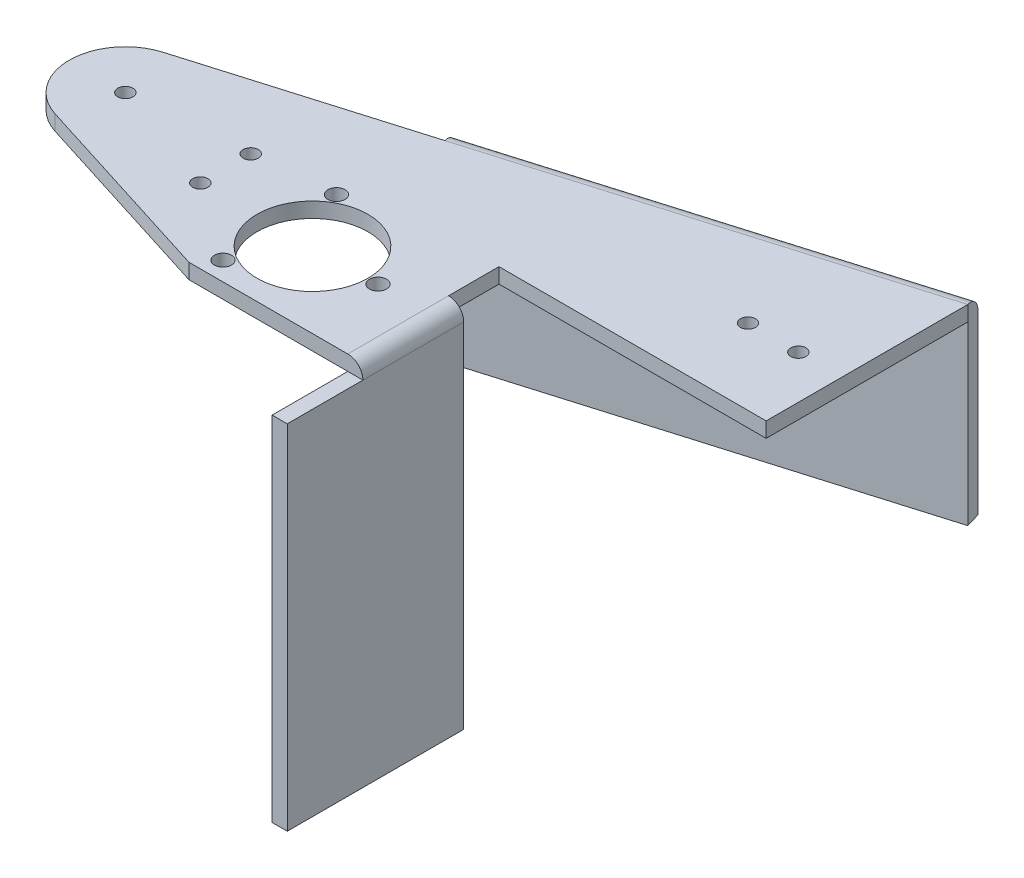
ISO-10303-21;
HEADER;
FILE_DESCRIPTION(('STEP AP214'),'2;1');
FILE_NAME('part.step','',(''),(''),'','','');
FILE_SCHEMA(('AUTOMOTIVE_DESIGN { 1 0 10303 214 1 1 1 1 }'));
ENDSEC;
DATA;
#1=APPLICATION_CONTEXT('core data for automotive mechanical design processes');
#2=APPLICATION_PROTOCOL_DEFINITION('international standard','automotive_design',2000,#1);
#3=PRODUCT_CONTEXT('',#1,'mechanical');
#4=PRODUCT('Part','Part','',(#3));
#5=PRODUCT_RELATED_PRODUCT_CATEGORY('part','',(#4));
#6=PRODUCT_DEFINITION_FORMATION('','',#4);
#7=PRODUCT_DEFINITION_CONTEXT('part definition',#1,'design');
#8=PRODUCT_DEFINITION('design','',#6,#7);
#9=PRODUCT_DEFINITION_SHAPE('','',#8);
#10=(LENGTH_UNIT() NAMED_UNIT(*) SI_UNIT(.MILLI.,.METRE.));
#11=(NAMED_UNIT(*) PLANE_ANGLE_UNIT() SI_UNIT($,.RADIAN.));
#12=(NAMED_UNIT(*) SI_UNIT($,.STERADIAN.) SOLID_ANGLE_UNIT());
#13=UNCERTAINTY_MEASURE_WITH_UNIT(LENGTH_MEASURE(1.E-05),#10,'distance_accuracy_value','');
#14=(GEOMETRIC_REPRESENTATION_CONTEXT(3) GLOBAL_UNCERTAINTY_ASSIGNED_CONTEXT((#13)) GLOBAL_UNIT_ASSIGNED_CONTEXT((#10,
#11,#12)) REPRESENTATION_CONTEXT('',''));
#15=CARTESIAN_POINT('',(0.,0.,0.));
#16=DIRECTION('',(0.,0.,1.));
#17=DIRECTION('',(1.,0.,0.));
#18=AXIS2_PLACEMENT_3D('',#15,#16,#17);
#19=CARTESIAN_POINT('',(-531.814143115865,-3.,-33.209876935335));
#20=DIRECTION('',(0.,-1.,0.));
#21=DIRECTION('',(0.,0.,-1.));
#22=AXIS2_PLACEMENT_3D('',#19,#20,#21);
#23=PLANE('',#22);
#24=CARTESIAN_POINT('',(-430.455543115792,-3.,-55.359876935335));
#25=DIRECTION('',(0.,-1.,0.));
#26=DIRECTION('',(0.,0.,-1.));
#27=AXIS2_PLACEMENT_3D('',#24,#25,#26);
#28=CIRCLE('',#27,1.49999999998116);
#29=CARTESIAN_POINT('',(-430.455543115792,-3.,-56.8598769353162));
#30=VERTEX_POINT('',#29);
#31=EDGE_CURVE('E203',#30,#30,#28,.T.);
#32=ORIENTED_EDGE('',*,*,#31,.F.);
#33=EDGE_LOOP('',(#32));
#34=FACE_BOUND('',#33,.T.);
#35=CARTESIAN_POINT('',(-493.344143115865,-3.,-14.1015466861375));
#36=DIRECTION('',(0.,-1.,0.));
#37=DIRECTION('',(0.,0.,-1.));
#38=AXIS2_PLACEMENT_3D('',#35,#36,#37);
#39=CIRCLE('',#38,1.70000000000349);
#40=CARTESIAN_POINT('',(-493.344143115865,-3.,-15.801546686141));
#41=VERTEX_POINT('',#40);
#42=EDGE_CURVE('E216',#41,#41,#39,.T.);
#43=ORIENTED_EDGE('',*,*,#42,.F.);
#44=EDGE_LOOP('',(#43));
#45=FACE_BOUND('',#44,.T.);
#46=CARTESIAN_POINT('',(-473.844143115865,-3.,-25.3598769353352));
#47=DIRECTION('',(0.,-1.,0.));
#48=DIRECTION('',(0.,0.,-1.));
#49=AXIS2_PLACEMENT_3D('',#46,#47,#48);
#50=CIRCLE('',#49,1.70000000000361);
#51=CARTESIAN_POINT('',(-473.844143115865,-3.,-27.0598769353388));
#52=VERTEX_POINT('',#51);
#53=EDGE_CURVE('E228',#52,#52,#50,.T.);
#54=ORIENTED_EDGE('',*,*,#53,.F.);
#55=EDGE_LOOP('',(#54));
#56=FACE_BOUND('',#55,.T.);
#57=CARTESIAN_POINT('',(-508.844143115865,-3.,-25.113476935338));
#58=DIRECTION('',(0.,-1.,0.));
#59=DIRECTION('',(0.,0.,-1.));
#60=AXIS2_PLACEMENT_3D('',#57,#58,#59);
#61=CIRCLE('',#60,1.49999999999997);
#62=CARTESIAN_POINT('',(-508.844143115865,-3.,-26.613476935338));
#63=VERTEX_POINT('',#62);
#64=EDGE_CURVE('E240',#63,#63,#61,.T.);
#65=ORIENTED_EDGE('',*,*,#64,.F.);
#66=EDGE_LOOP('',(#65));
#67=FACE_BOUND('',#66,.T.);
#68=CARTESIAN_POINT('',(-531.814143115865,-3.,-33.209876935335));
#69=DIRECTION('',(0.,-1.,0.));
#70=DIRECTION('',(0.,0.,-1.));
#71=AXIS2_PLACEMENT_3D('',#68,#69,#70);
#72=CIRCLE('',#71,1.49999999999997);
#73=CARTESIAN_POINT('',(-531.814143115865,-3.,-34.709876935335));
#74=VERTEX_POINT('',#73);
#75=EDGE_CURVE('E252',#74,#74,#72,.T.);
#76=ORIENTED_EDGE('',*,*,#75,.F.);
#77=EDGE_LOOP('',(#76));
#78=FACE_BOUND('',#77,.T.);
#79=CARTESIAN_POINT('',(-508.844143115865,-3.,-35.113476935338));
#80=DIRECTION('',(0.,-1.,0.));
#81=DIRECTION('',(0.,0.,-1.));
#82=AXIS2_PLACEMENT_3D('',#79,#80,#81);
#83=CIRCLE('',#82,1.49999999999997);
#84=CARTESIAN_POINT('',(-508.844143115865,-3.,-36.613476935338));
#85=VERTEX_POINT('',#84);
#86=EDGE_CURVE('E246',#85,#85,#83,.T.);
#87=ORIENTED_EDGE('',*,*,#86,.F.);
#88=EDGE_LOOP('',(#87));
#89=FACE_BOUND('',#88,.T.);
#90=CARTESIAN_POINT('',(-486.844143115865,-3.,-25.359876935335));
#91=DIRECTION('',(0.,-1.,0.));
#92=DIRECTION('',(0.,0.,-1.));
#93=AXIS2_PLACEMENT_3D('',#90,#91,#92);
#94=CIRCLE('',#93,11.0000000000028);
#95=CARTESIAN_POINT('',(-486.844143115865,-3.,-36.3598769353378));
#96=VERTEX_POINT('',#95);
#97=EDGE_CURVE('E234',#96,#96,#94,.T.);
#98=ORIENTED_EDGE('',*,*,#97,.F.);
#99=EDGE_LOOP('',(#98));
#100=FACE_BOUND('',#99,.T.);
#101=CARTESIAN_POINT('',(-493.344143115865,-3.,-36.6182071845329));
#102=DIRECTION('',(0.,-1.,0.));
#103=DIRECTION('',(0.,0.,-1.));
#104=AXIS2_PLACEMENT_3D('',#101,#102,#103);
#105=CIRCLE('',#104,1.70000000000345);
#106=CARTESIAN_POINT('',(-493.344143115865,-3.,-38.3182071845364));
#107=VERTEX_POINT('',#106);
#108=EDGE_CURVE('E222',#107,#107,#105,.T.);
#109=ORIENTED_EDGE('',*,*,#108,.F.);
#110=EDGE_LOOP('',(#109));
#111=FACE_BOUND('',#110,.T.);
#112=CARTESIAN_POINT('',(-420.455543115792,-3.,-55.359876935335));
#113=DIRECTION('',(0.,-1.,0.));
#114=DIRECTION('',(0.,0.,-1.));
#115=AXIS2_PLACEMENT_3D('',#112,#113,#114);
#116=CIRCLE('',#115,1.49999999998116);
#117=CARTESIAN_POINT('',(-420.455543115792,-3.,-56.8598769353162));
#118=VERTEX_POINT('',#117);
#119=EDGE_CURVE('E210',#118,#118,#116,.T.);
#120=ORIENTED_EDGE('',*,*,#119,.F.);
#121=EDGE_LOOP('',(#120));
#122=FACE_BOUND('',#121,.T.);
#123=DIRECTION('',(0.958808610714418,0.,-0.284052896517335));
#124=VECTOR('',#123,1.);
#125=CARTESIAN_POINT('',(-534.975651854103,-3.,-43.8814167725865));
#126=LINE('',#125,#124);
#127=CARTESIAN_POINT('',(-534.975651854103,-3.,-43.8814167725865));
#128=VERTEX_POINT('',#127);
#129=CARTESIAN_POINT('',(-491.844143115865,-3.,-56.6593891972715));
#130=VERTEX_POINT('',#129);
#131=EDGE_CURVE('E261',#128,#130,#126,.T.);
#132=ORIENTED_EDGE('',*,*,#131,.T.);
#133=DIRECTION('',(-0.958808610714418,0.,0.284052896517336));
#134=VECTOR('',#133,1.);
#135=CARTESIAN_POINT('',(-491.844143115865,-2.99999999997629,-56.6593891972714));
#136=LINE('',#135,#134);
#137=CARTESIAN_POINT('',(-411.844143115865,-2.9999999999805,-80.359876935335));
#138=VERTEX_POINT('',#137);
#139=EDGE_CURVE('E165',#138,#130,#136,.T.);
#140=ORIENTED_EDGE('',*,*,#139,.F.);
#141=DIRECTION('',(0.,0.,1.));
#142=VECTOR('',#141,1.);
#143=CARTESIAN_POINT('',(-411.844143115865,-3.,-40.359876935335));
#144=LINE('',#143,#142);
#145=CARTESIAN_POINT('',(-411.844143115865,-3.,-40.359876935335));
#146=VERTEX_POINT('',#145);
#147=EDGE_CURVE('E264',#138,#146,#144,.T.);
#148=ORIENTED_EDGE('',*,*,#147,.T.);
#149=DIRECTION('',(-1.,0.,0.));
#150=VECTOR('',#149,1.);
#151=CARTESIAN_POINT('',(-464.844143115865,-3.,-40.359876935335));
#152=LINE('',#151,#150);
#153=CARTESIAN_POINT('',(-464.844143115865,-3.,-40.359876935335));
#154=VERTEX_POINT('',#153);
#155=EDGE_CURVE('E266',#146,#154,#152,.T.);
#156=ORIENTED_EDGE('',*,*,#155,.T.);
#157=DIRECTION('',(0.,0.,1.));
#158=VECTOR('',#157,1.);
#159=CARTESIAN_POINT('',(-464.844143115865,-3.,-30.359876935335));
#160=LINE('',#159,#158);
#161=CARTESIAN_POINT('',(-464.844143115865,-2.99999999997735,-30.359876935335));
#162=VERTEX_POINT('',#161);
#163=EDGE_CURVE('E268',#154,#162,#160,.T.);
#164=ORIENTED_EDGE('',*,*,#163,.T.);
#165=DIRECTION('',(0.,0.,-1.));
#166=VECTOR('',#165,1.);
#167=CARTESIAN_POINT('',(-464.844143115865,-2.99999999997697,4.64012306466499));
#168=LINE('',#167,#166);
#169=CARTESIAN_POINT('',(-464.844143115865,-3.,-10.359876935335));
#170=VERTEX_POINT('',#169);
#171=EDGE_CURVE('E195',#170,#162,#168,.T.);
#172=ORIENTED_EDGE('',*,*,#171,.F.);
#173=DIRECTION('',(-1.,0.,0.));
#174=VECTOR('',#173,1.);
#175=CARTESIAN_POINT('',(-461.844143115865,-3.,-10.359876935335));
#176=LINE('',#175,#174);
#177=CARTESIAN_POINT('',(-496.344143115865,-3.,-10.359876935335));
#178=VERTEX_POINT('',#177);
#179=EDGE_CURVE('E271',#170,#178,#176,.T.);
#180=ORIENTED_EDGE('',*,*,#179,.T.);
#181=DIRECTION('',(-0.953743563350818,0.,-0.300621382085313));
#182=VECTOR('',#181,1.);
#183=CARTESIAN_POINT('',(-496.344143115865,-3.,-10.359876935335));
#184=LINE('',#183,#182);
#185=CARTESIAN_POINT('',(-535.160059098475,-3.,-22.5947110752404));
#186=VERTEX_POINT('',#185);
#187=EDGE_CURVE('E275',#178,#186,#184,.T.);
#188=ORIENTED_EDGE('',*,*,#187,.T.);
#189=CARTESIAN_POINT('',(-531.814143115865,-3.,-33.209876935335));
#190=DIRECTION('',(0.,-1.,0.));
#191=DIRECTION('',(0.,0.,-1.));
#192=AXIS2_PLACEMENT_3D('',#189,#190,#191);
#193=CIRCLE('',#192,11.13);
#194=EDGE_CURVE('E258',#186,#128,#193,.T.);
#195=ORIENTED_EDGE('',*,*,#194,.T.);
#196=EDGE_LOOP('',(#132,#140,#148,#156,#164,#172,#180,#188,#195));
#197=FACE_BOUND('',#196,.T.);
#198=ADVANCED_FACE('F33',(#34,#45,#56,#67,#78,#89,#100,#111,#122,#197),#23,.T.);
#199=CARTESIAN_POINT('',(-531.814143115865,0.,-33.209876935335));
#200=DIRECTION('',(0.,-1.,0.));
#201=DIRECTION('',(0.,0.,-1.));
#202=AXIS2_PLACEMENT_3D('',#199,#200,#201);
#203=PLANE('',#202);
#204=CARTESIAN_POINT('',(-420.455543115792,0.,-55.359876935335));
#205=DIRECTION('',(0.,-1.,0.));
#206=DIRECTION('',(0.,0.,-1.));
#207=AXIS2_PLACEMENT_3D('',#204,#205,#206);
#208=CIRCLE('',#207,1.49999999998116);
#209=CARTESIAN_POINT('',(-420.455543115792,0.,-56.8598769353162));
#210=VERTEX_POINT('',#209);
#211=EDGE_CURVE('E206',#210,#210,#208,.T.);
#212=ORIENTED_EDGE('',*,*,#211,.T.);
#213=EDGE_LOOP('',(#212));
#214=FACE_BOUND('',#213,.T.);
#215=CARTESIAN_POINT('',(-493.344143115865,0.,-36.6182071845329));
#216=DIRECTION('',(0.,-1.,0.));
#217=DIRECTION('',(0.,0.,-1.));
#218=AXIS2_PLACEMENT_3D('',#215,#216,#217);
#219=CIRCLE('',#218,1.70000000000345);
#220=CARTESIAN_POINT('',(-493.344143115865,0.,-38.3182071845364));
#221=VERTEX_POINT('',#220);
#222=EDGE_CURVE('E219',#221,#221,#219,.T.);
#223=ORIENTED_EDGE('',*,*,#222,.T.);
#224=EDGE_LOOP('',(#223));
#225=FACE_BOUND('',#224,.T.);
#226=CARTESIAN_POINT('',(-486.844143115865,0.,-25.359876935335));
#227=DIRECTION('',(0.,-1.,0.));
#228=DIRECTION('',(0.,0.,-1.));
#229=AXIS2_PLACEMENT_3D('',#226,#227,#228);
#230=CIRCLE('',#229,11.0000000000028);
#231=CARTESIAN_POINT('',(-486.844143115865,0.,-36.3598769353378));
#232=VERTEX_POINT('',#231);
#233=EDGE_CURVE('E231',#232,#232,#230,.T.);
#234=ORIENTED_EDGE('',*,*,#233,.T.);
#235=EDGE_LOOP('',(#234));
#236=FACE_BOUND('',#235,.T.);
#237=CARTESIAN_POINT('',(-508.844143115865,0.,-35.113476935338));
#238=DIRECTION('',(0.,-1.,0.));
#239=DIRECTION('',(0.,0.,-1.));
#240=AXIS2_PLACEMENT_3D('',#237,#238,#239);
#241=CIRCLE('',#240,1.49999999999997);
#242=CARTESIAN_POINT('',(-508.844143115865,0.,-36.613476935338));
#243=VERTEX_POINT('',#242);
#244=EDGE_CURVE('E243',#243,#243,#241,.T.);
#245=ORIENTED_EDGE('',*,*,#244,.T.);
#246=EDGE_LOOP('',(#245));
#247=FACE_BOUND('',#246,.T.);
#248=DIRECTION('',(-1.,0.,0.));
#249=VECTOR('',#248,1.);
#250=CARTESIAN_POINT('',(-461.844143115865,0.,-10.359876935335));
#251=LINE('',#250,#249);
#252=CARTESIAN_POINT('',(-464.844143115865,0.,-10.359876935335));
#253=VERTEX_POINT('',#252);
#254=CARTESIAN_POINT('',(-496.344143115865,0.,-10.359876935335));
#255=VERTEX_POINT('',#254);
#256=EDGE_CURVE('E400',#253,#255,#251,.T.);
#257=ORIENTED_EDGE('',*,*,#256,.F.);
#258=DIRECTION('',(0.,0.,1.));
#259=VECTOR('',#258,1.);
#260=CARTESIAN_POINT('',(-464.844143115865,0.,-33.209876935335));
#261=LINE('',#260,#259);
#262=CARTESIAN_POINT('',(-464.844143115865,0.,-30.359876935335));
#263=VERTEX_POINT('',#262);
#264=EDGE_CURVE('E294',#253,#263,#261,.F.);
#265=ORIENTED_EDGE('',*,*,#264,.T.);
#266=DIRECTION('',(0.,0.,1.));
#267=VECTOR('',#266,1.);
#268=CARTESIAN_POINT('',(-464.844143115865,0.,-30.359876935335));
#269=LINE('',#268,#267);
#270=CARTESIAN_POINT('',(-464.844143115865,0.,-40.359876935335));
#271=VERTEX_POINT('',#270);
#272=EDGE_CURVE('E397',#271,#263,#269,.T.);
#273=ORIENTED_EDGE('',*,*,#272,.F.);
#274=DIRECTION('',(-1.,0.,0.));
#275=VECTOR('',#274,1.);
#276=CARTESIAN_POINT('',(-464.844143115865,0.,-40.359876935335));
#277=LINE('',#276,#275);
#278=CARTESIAN_POINT('',(-411.844143115865,0.,-40.359876935335));
#279=VERTEX_POINT('',#278);
#280=EDGE_CURVE('E321',#279,#271,#277,.T.);
#281=ORIENTED_EDGE('',*,*,#280,.F.);
#282=DIRECTION('',(0.,0.,1.));
#283=VECTOR('',#282,1.);
#284=CARTESIAN_POINT('',(-411.844143115865,0.,-40.359876935335));
#285=LINE('',#284,#283);
#286=CARTESIAN_POINT('',(-411.844143115865,0.,-80.359876935335));
#287=VERTEX_POINT('',#286);
#288=EDGE_CURVE('E310',#287,#279,#285,.T.);
#289=ORIENTED_EDGE('',*,*,#288,.F.);
#290=DIRECTION('',(0.958808610714418,0.,-0.284052896517336));
#291=VECTOR('',#290,1.);
#292=CARTESIAN_POINT('',(-534.975651854103,0.,-43.8814167725865));
#293=LINE('',#292,#291);
#294=CARTESIAN_POINT('',(-491.844143115865,0.,-56.6593891972715));
#295=VERTEX_POINT('',#294);
#296=EDGE_CURVE('E290',#287,#295,#293,.F.);
#297=ORIENTED_EDGE('',*,*,#296,.T.);
#298=DIRECTION('',(0.958808610714418,0.,-0.284052896517335));
#299=VECTOR('',#298,1.);
#300=CARTESIAN_POINT('',(-534.975651854103,0.,-43.8814167725865));
#301=LINE('',#300,#299);
#302=CARTESIAN_POINT('',(-534.975651854103,0.,-43.8814167725865));
#303=VERTEX_POINT('',#302);
#304=EDGE_CURVE('E322',#303,#295,#301,.T.);
#305=ORIENTED_EDGE('',*,*,#304,.F.);
#306=CARTESIAN_POINT('',(-531.814143115865,0.,-33.209876935335));
#307=DIRECTION('',(0.,-1.,0.));
#308=DIRECTION('',(0.,0.,-1.));
#309=AXIS2_PLACEMENT_3D('',#306,#307,#308);
#310=CIRCLE('',#309,11.13);
#311=CARTESIAN_POINT('',(-535.160059098475,0.,-22.5947110752404));
#312=VERTEX_POINT('',#311);
#313=EDGE_CURVE('E255',#312,#303,#310,.T.);
#314=ORIENTED_EDGE('',*,*,#313,.F.);
#315=DIRECTION('',(-0.953743563350818,0.,-0.300621382085313));
#316=VECTOR('',#315,1.);
#317=CARTESIAN_POINT('',(-496.344143115865,0.,-10.359876935335));
#318=LINE('',#317,#316);
#319=EDGE_CURVE('E262',#255,#312,#318,.T.);
#320=ORIENTED_EDGE('',*,*,#319,.F.);
#321=EDGE_LOOP('',(#257,#265,#273,#281,#289,#297,#305,#314,#320));
#322=FACE_BOUND('',#321,.T.);
#323=CARTESIAN_POINT('',(-531.814143115865,0.,-33.209876935335));
#324=DIRECTION('',(0.,-1.,0.));
#325=DIRECTION('',(0.,0.,-1.));
#326=AXIS2_PLACEMENT_3D('',#323,#324,#325);
#327=CIRCLE('',#326,1.49999999999997);
#328=CARTESIAN_POINT('',(-531.814143115865,0.,-34.709876935335));
#329=VERTEX_POINT('',#328);
#330=EDGE_CURVE('E249',#329,#329,#327,.T.);
#331=ORIENTED_EDGE('',*,*,#330,.T.);
#332=EDGE_LOOP('',(#331));
#333=FACE_BOUND('',#332,.T.);
#334=CARTESIAN_POINT('',(-508.844143115865,0.,-25.113476935338));
#335=DIRECTION('',(0.,-1.,0.));
#336=DIRECTION('',(0.,0.,-1.));
#337=AXIS2_PLACEMENT_3D('',#334,#335,#336);
#338=CIRCLE('',#337,1.49999999999997);
#339=CARTESIAN_POINT('',(-508.844143115865,0.,-26.613476935338));
#340=VERTEX_POINT('',#339);
#341=EDGE_CURVE('E237',#340,#340,#338,.T.);
#342=ORIENTED_EDGE('',*,*,#341,.T.);
#343=EDGE_LOOP('',(#342));
#344=FACE_BOUND('',#343,.T.);
#345=CARTESIAN_POINT('',(-473.844143115865,0.,-25.3598769353352));
#346=DIRECTION('',(0.,-1.,0.));
#347=DIRECTION('',(0.,0.,-1.));
#348=AXIS2_PLACEMENT_3D('',#345,#346,#347);
#349=CIRCLE('',#348,1.70000000000361);
#350=CARTESIAN_POINT('',(-473.844143115865,0.,-27.0598769353388));
#351=VERTEX_POINT('',#350);
#352=EDGE_CURVE('E225',#351,#351,#349,.T.);
#353=ORIENTED_EDGE('',*,*,#352,.T.);
#354=EDGE_LOOP('',(#353));
#355=FACE_BOUND('',#354,.T.);
#356=CARTESIAN_POINT('',(-493.344143115865,0.,-14.1015466861375));
#357=DIRECTION('',(0.,-1.,0.));
#358=DIRECTION('',(0.,0.,-1.));
#359=AXIS2_PLACEMENT_3D('',#356,#357,#358);
#360=CIRCLE('',#359,1.70000000000349);
#361=CARTESIAN_POINT('',(-493.344143115865,0.,-15.801546686141));
#362=VERTEX_POINT('',#361);
#363=EDGE_CURVE('E213',#362,#362,#360,.T.);
#364=ORIENTED_EDGE('',*,*,#363,.T.);
#365=EDGE_LOOP('',(#364));
#366=FACE_BOUND('',#365,.T.);
#367=CARTESIAN_POINT('',(-430.455543115792,0.,-55.359876935335));
#368=DIRECTION('',(0.,-1.,0.));
#369=DIRECTION('',(0.,0.,-1.));
#370=AXIS2_PLACEMENT_3D('',#367,#368,#369);
#371=CIRCLE('',#370,1.49999999998116);
#372=CARTESIAN_POINT('',(-430.455543115792,0.,-56.8598769353162));
#373=VERTEX_POINT('',#372);
#374=EDGE_CURVE('E207',#373,#373,#371,.T.);
#375=ORIENTED_EDGE('',*,*,#374,.T.);
#376=EDGE_LOOP('',(#375));
#377=FACE_BOUND('',#376,.T.);
#378=ADVANCED_FACE('F317',(#214,#225,#236,#247,#322,#333,#344,#355,#366,#377),#203,.F.);
#379=CARTESIAN_POINT('',(-531.814143115865,-3.,-33.209876935335));
#380=DIRECTION('',(0.,1.,0.));
#381=DIRECTION('',(0.,0.,1.));
#382=AXIS2_PLACEMENT_3D('',#379,#380,#381);
#383=CYLINDRICAL_SURFACE('',#382,11.13);
#384=ORIENTED_EDGE('',*,*,#313,.T.);
#385=DIRECTION('',(0.,1.,0.));
#386=VECTOR('',#385,1.);
#387=CARTESIAN_POINT('',(-534.975651854103,-3.,-43.8814167725865));
#388=LINE('',#387,#386);
#389=EDGE_CURVE('E281',#128,#303,#388,.T.);
#390=ORIENTED_EDGE('',*,*,#389,.F.);
#391=ORIENTED_EDGE('',*,*,#194,.F.);
#392=DIRECTION('',(0.,1.,0.));
#393=VECTOR('',#392,1.);
#394=CARTESIAN_POINT('',(-535.160059098475,-3.,-22.5947110752404));
#395=LINE('',#394,#393);
#396=EDGE_CURVE('E392',#186,#312,#395,.T.);
#397=ORIENTED_EDGE('',*,*,#396,.T.);
#398=EDGE_LOOP('',(#384,#390,#391,#397));
#399=FACE_BOUND('',#398,.T.);
#400=ADVANCED_FACE('F336',(#399),#383,.T.);
#401=CARTESIAN_POINT('',(-534.975651854103,-3.,-43.8814167725865));
#402=DIRECTION('',(0.284052896517335,0.,0.958808610714418));
#403=DIRECTION('',(0.958808610714418,0.,-0.284052896517335));
#404=AXIS2_PLACEMENT_3D('',#401,#402,#403);
#405=PLANE('',#404);
#406=ORIENTED_EDGE('',*,*,#304,.T.);
#407=DIRECTION('',(0.,1.,0.));
#408=VECTOR('',#407,1.);
#409=CARTESIAN_POINT('',(-491.844143115865,-3.,-56.6593891972715));
#410=LINE('',#409,#408);
#411=EDGE_CURVE('E150',#130,#295,#410,.T.);
#412=ORIENTED_EDGE('',*,*,#411,.F.);
#413=ORIENTED_EDGE('',*,*,#131,.F.);
#414=ORIENTED_EDGE('',*,*,#389,.T.);
#415=EDGE_LOOP('',(#406,#412,#413,#414));
#416=FACE_BOUND('',#415,.T.);
#417=ADVANCED_FACE('F377',(#416),#405,.F.);
#418=CARTESIAN_POINT('',(-491.844143115865,-3.,-56.6593891972715));
#419=DIRECTION('',(0.958808610714385,0.,-0.284052896517447));
#420=DIRECTION('',(-0.284052896517447,0.,-0.958808610714385));
#421=AXIS2_PLACEMENT_3D('',#418,#419,#420);
#422=PLANE('',#421);
#423=ORIENTED_EDGE('',*,*,#411,.T.);
#424=CARTESIAN_POINT('',(-491.844143115865,-3.,-56.6593891972715));
#425=DIRECTION('',(0.958808610714385,0.,-0.284052896517447));
#426=DIRECTION('',(-0.284052896517447,0.,-0.958808610714385));
#427=AXIS2_PLACEMENT_3D('',#424,#425,#426);
#428=CIRCLE('',#427,3.);
#429=CARTESIAN_POINT('',(-492.696301805417,-3.,-59.5358150294147));
#430=VERTEX_POINT('',#429);
#431=EDGE_CURVE('E11',#295,#430,#428,.F.);
#432=ORIENTED_EDGE('',*,*,#431,.T.);
#433=DIRECTION('',(0.,1.,0.));
#434=VECTOR('',#433,1.);
#435=CARTESIAN_POINT('',(-492.696301805417,-3.,-59.5358150294147));
#436=LINE('',#435,#434);
#437=CARTESIAN_POINT('',(-492.696301805419,-37.9999999999763,-59.5358150294143));
#438=VERTEX_POINT('',#437);
#439=EDGE_CURVE('E143',#438,#430,#436,.T.);
#440=ORIENTED_EDGE('',*,*,#439,.F.);
#441=DIRECTION('',(-0.284052896517339,0.,-0.958808610714417));
#442=VECTOR('',#441,1.);
#443=CARTESIAN_POINT('',(-492.696301805419,-37.9999999999763,-59.5358150294143));
#444=LINE('',#443,#442);
#445=CARTESIAN_POINT('',(-491.844143115867,-37.9999999999763,-56.6593891972711));
#446=VERTEX_POINT('',#445);
#447=EDGE_CURVE('E148',#446,#438,#444,.T.);
#448=ORIENTED_EDGE('',*,*,#447,.F.);
#449=DIRECTION('',(0.,1.,0.));
#450=VECTOR('',#449,1.);
#451=CARTESIAN_POINT('',(-491.844143115867,-37.9999999999763,-56.6593891972711));
#452=LINE('',#451,#450);
#453=EDGE_CURVE('E171',#446,#130,#452,.T.);
#454=ORIENTED_EDGE('',*,*,#453,.T.);
#455=EDGE_LOOP('',(#423,#432,#440,#448,#454));
#456=FACE_BOUND('',#455,.T.);
#457=ADVANCED_FACE('F145',(#456),#422,.F.);
#458=CARTESIAN_POINT('',(-492.696301805417,-3.,-59.5358150294147));
#459=DIRECTION('',(0.284052896517336,0.,0.958808610714418));
#460=DIRECTION('',(0.958808610714418,0.,-0.284052896517336));
#461=AXIS2_PLACEMENT_3D('',#458,#459,#460);
#462=PLANE('',#461);
#463=ORIENTED_EDGE('',*,*,#439,.T.);
#464=DIRECTION('',(0.958808610714418,0.,-0.284052896517336));
#465=VECTOR('',#464,1.);
#466=CARTESIAN_POINT('',(-492.696301805417,-3.,-59.5358150294147));
#467=LINE('',#466,#465);
#468=CARTESIAN_POINT('',(-412.696301805417,-3.,-83.2363027674783));
#469=VERTEX_POINT('',#468);
#470=EDGE_CURVE('E298',#430,#469,#467,.T.);
#471=ORIENTED_EDGE('',*,*,#470,.T.);
#472=DIRECTION('',(0.,1.,0.));
#473=VECTOR('',#472,1.);
#474=CARTESIAN_POINT('',(-412.696301805417,-3.,-83.2363027674783));
#475=LINE('',#474,#473);
#476=CARTESIAN_POINT('',(-412.696301805419,-37.9999999999805,-83.2363027674779));
#477=VERTEX_POINT('',#476);
#478=EDGE_CURVE('E151',#477,#469,#475,.T.);
#479=ORIENTED_EDGE('',*,*,#478,.F.);
#480=DIRECTION('',(0.958808610714418,0.,-0.284052896517336));
#481=VECTOR('',#480,1.);
#482=CARTESIAN_POINT('',(-492.696301805419,-37.9999999999763,-59.5358150294143));
#483=LINE('',#482,#481);
#484=EDGE_CURVE('E154',#438,#477,#483,.T.);
#485=ORIENTED_EDGE('',*,*,#484,.F.);
#486=EDGE_LOOP('',(#463,#471,#479,#485));
#487=FACE_BOUND('',#486,.T.);
#488=ADVANCED_FACE('F155',(#487),#462,.F.);
#489=CARTESIAN_POINT('',(-412.696301805417,-3.,-83.2363027674783));
#490=DIRECTION('',(-0.958808610714411,0.,0.284052896517357));
#491=DIRECTION('',(0.284052896517357,0.,0.958808610714411));
#492=AXIS2_PLACEMENT_3D('',#489,#490,#491);
#493=PLANE('',#492);
#494=ORIENTED_EDGE('',*,*,#478,.T.);
#495=CARTESIAN_POINT('',(-411.844143115865,-3.,-80.359876935335));
#496=DIRECTION('',(-0.958808610714411,0.,0.284052896517357));
#497=DIRECTION('',(0.284052896517357,0.,0.958808610714411));
#498=AXIS2_PLACEMENT_3D('',#495,#496,#497);
#499=CIRCLE('',#498,3.);
#500=EDGE_CURVE('E41',#469,#287,#499,.F.);
#501=ORIENTED_EDGE('',*,*,#500,.T.);
#502=DIRECTION('',(0.,1.,0.));
#503=VECTOR('',#502,1.);
#504=CARTESIAN_POINT('',(-411.844143115865,-3.,-80.359876935335));
#505=LINE('',#504,#503);
#506=EDGE_CURVE('E304',#138,#287,#505,.T.);
#507=ORIENTED_EDGE('',*,*,#506,.F.);
#508=DIRECTION('',(0.,1.,0.));
#509=VECTOR('',#508,1.);
#510=CARTESIAN_POINT('',(-411.844143115867,-37.9999999999805,-80.3598769353346));
#511=LINE('',#510,#509);
#512=CARTESIAN_POINT('',(-411.844143115867,-37.9999999999805,-80.3598769353346));
#513=VERTEX_POINT('',#512);
#514=EDGE_CURVE('E174',#513,#138,#511,.T.);
#515=ORIENTED_EDGE('',*,*,#514,.F.);
#516=DIRECTION('',(0.284052896517339,0.,0.958808610714417));
#517=VECTOR('',#516,1.);
#518=CARTESIAN_POINT('',(-412.696301805419,-37.9999999999805,-83.2363027674779));
#519=LINE('',#518,#517);
#520=EDGE_CURVE('E159',#477,#513,#519,.T.);
#521=ORIENTED_EDGE('',*,*,#520,.F.);
#522=EDGE_LOOP('',(#494,#501,#507,#515,#521));
#523=FACE_BOUND('',#522,.T.);
#524=ADVANCED_FACE('F302',(#523),#493,.F.);
#525=CARTESIAN_POINT('',(-411.844143115865,-3.,-40.359876935335));
#526=DIRECTION('',(-1.,0.,0.));
#527=DIRECTION('',(0.,0.,1.));
#528=AXIS2_PLACEMENT_3D('',#525,#526,#527);
#529=PLANE('',#528);
#530=ORIENTED_EDGE('',*,*,#288,.T.);
#531=DIRECTION('',(0.,1.,0.));
#532=VECTOR('',#531,1.);
#533=CARTESIAN_POINT('',(-411.844143115865,-3.,-40.359876935335));
#534=LINE('',#533,#532);
#535=EDGE_CURVE('E312',#146,#279,#534,.T.);
#536=ORIENTED_EDGE('',*,*,#535,.F.);
#537=ORIENTED_EDGE('',*,*,#147,.F.);
#538=ORIENTED_EDGE('',*,*,#506,.T.);
#539=EDGE_LOOP('',(#530,#536,#537,#538));
#540=FACE_BOUND('',#539,.T.);
#541=ADVANCED_FACE('F308',(#540),#529,.F.);
#542=CARTESIAN_POINT('',(-464.844143115865,-3.,-40.359876935335));
#543=DIRECTION('',(0.,0.,-1.));
#544=DIRECTION('',(-1.,0.,0.));
#545=AXIS2_PLACEMENT_3D('',#542,#543,#544);
#546=PLANE('',#545);
#547=ORIENTED_EDGE('',*,*,#280,.T.);
#548=DIRECTION('',(0.,1.,0.));
#549=VECTOR('',#548,1.);
#550=CARTESIAN_POINT('',(-464.844143115865,-3.,-40.359876935335));
#551=LINE('',#550,#549);
#552=EDGE_CURVE('E413',#154,#271,#551,.T.);
#553=ORIENTED_EDGE('',*,*,#552,.F.);
#554=ORIENTED_EDGE('',*,*,#155,.F.);
#555=ORIENTED_EDGE('',*,*,#535,.T.);
#556=EDGE_LOOP('',(#547,#553,#554,#555));
#557=FACE_BOUND('',#556,.T.);
#558=ADVANCED_FACE('F364',(#557),#546,.F.);
#559=CARTESIAN_POINT('',(-464.844143115865,-3.,-30.359876935335));
#560=DIRECTION('',(-1.,0.,0.));
#561=DIRECTION('',(0.,0.,1.));
#562=AXIS2_PLACEMENT_3D('',#559,#560,#561);
#563=PLANE('',#562);
#564=ORIENTED_EDGE('',*,*,#272,.T.);
#565=DIRECTION('',(0.,1.,0.));
#566=VECTOR('',#565,1.);
#567=CARTESIAN_POINT('',(-464.844143115865,-3.,-30.359876935335));
#568=LINE('',#567,#566);
#569=EDGE_CURVE('E410',#162,#263,#568,.T.);
#570=ORIENTED_EDGE('',*,*,#569,.F.);
#571=ORIENTED_EDGE('',*,*,#163,.F.);
#572=ORIENTED_EDGE('',*,*,#552,.T.);
#573=EDGE_LOOP('',(#564,#570,#571,#572));
#574=FACE_BOUND('',#573,.T.);
#575=ADVANCED_FACE('F360',(#574),#563,.F.);
#576=CARTESIAN_POINT('',(-464.844143115865,-3.,-30.359876935335));
#577=DIRECTION('',(0.,0.,1.));
#578=DIRECTION('',(1.,0.,0.));
#579=AXIS2_PLACEMENT_3D('',#576,#577,#578);
#580=PLANE('',#579);
#581=ORIENTED_EDGE('',*,*,#569,.T.);
#582=CARTESIAN_POINT('',(-464.844143115865,-3.,-30.359876935335));
#583=DIRECTION('',(0.,0.,1.));
#584=DIRECTION('',(1.,0.,0.));
#585=AXIS2_PLACEMENT_3D('',#582,#583,#584);
#586=CIRCLE('',#585,3.);
#587=CARTESIAN_POINT('',(-461.844143115865,-3.,-30.359876935335));
#588=VERTEX_POINT('',#587);
#589=EDGE_CURVE('E296',#263,#588,#586,.F.);
#590=ORIENTED_EDGE('',*,*,#589,.T.);
#591=DIRECTION('',(0.,1.,0.));
#592=VECTOR('',#591,1.);
#593=CARTESIAN_POINT('',(-461.844143115865,-3.,-30.359876935335));
#594=LINE('',#593,#592);
#595=CARTESIAN_POINT('',(-461.844143115869,-72.9999999999775,-30.3598769353343));
#596=VERTEX_POINT('',#595);
#597=EDGE_CURVE('E407',#596,#588,#594,.T.);
#598=ORIENTED_EDGE('',*,*,#597,.F.);
#599=DIRECTION('',(1.,0.,0.));
#600=VECTOR('',#599,1.);
#601=CARTESIAN_POINT('',(-464.844143115869,-72.9999999999773,-30.3598769353343));
#602=LINE('',#601,#600);
#603=CARTESIAN_POINT('',(-464.844143115869,-72.9999999999773,-30.3598769353343));
#604=VERTEX_POINT('',#603);
#605=EDGE_CURVE('E184',#604,#596,#602,.T.);
#606=ORIENTED_EDGE('',*,*,#605,.F.);
#607=DIRECTION('',(0.,1.,0.));
#608=VECTOR('',#607,1.);
#609=CARTESIAN_POINT('',(-464.844143115869,-72.9999999999773,-30.3598769353343));
#610=LINE('',#609,#608);
#611=EDGE_CURVE('E423',#604,#162,#610,.T.);
#612=ORIENTED_EDGE('',*,*,#611,.T.);
#613=EDGE_LOOP('',(#581,#590,#598,#606,#612));
#614=FACE_BOUND('',#613,.T.);
#615=ADVANCED_FACE('F356',(#614),#580,.F.);
#616=CARTESIAN_POINT('',(-461.844143115865,-3.,-30.359876935335));
#617=DIRECTION('',(-1.,0.,0.));
#618=DIRECTION('',(0.,0.,1.));
#619=AXIS2_PLACEMENT_3D('',#616,#617,#618);
#620=PLANE('',#619);
#621=ORIENTED_EDGE('',*,*,#597,.T.);
#622=DIRECTION('',(0.,0.,1.));
#623=VECTOR('',#622,1.);
#624=CARTESIAN_POINT('',(-461.844143115865,-3.,-30.359876935335));
#625=LINE('',#624,#623);
#626=CARTESIAN_POINT('',(-461.844143115865,-3.,-10.359876935335));
#627=VERTEX_POINT('',#626);
#628=EDGE_CURVE('E283',#588,#627,#625,.T.);
#629=ORIENTED_EDGE('',*,*,#628,.T.);
#630=DIRECTION('',(0.,0.,1.));
#631=VECTOR('',#630,1.);
#632=CARTESIAN_POINT('',(-461.844143115865,-2.99999999997749,-30.359876935335));
#633=LINE('',#632,#631);
#634=CARTESIAN_POINT('',(-461.844143115865,-2.99999999997712,4.64012306466499));
#635=VERTEX_POINT('',#634);
#636=EDGE_CURVE('E182',#627,#635,#633,.T.);
#637=ORIENTED_EDGE('',*,*,#636,.T.);
#638=DIRECTION('',(0.,1.,0.));
#639=VECTOR('',#638,1.);
#640=CARTESIAN_POINT('',(-461.844143115869,-72.9999999999771,4.64012306466574));
#641=LINE('',#640,#639);
#642=CARTESIAN_POINT('',(-461.844143115869,-72.9999999999771,4.64012306466574));
#643=VERTEX_POINT('',#642);
#644=EDGE_CURVE('E189',#643,#635,#641,.T.);
#645=ORIENTED_EDGE('',*,*,#644,.F.);
#646=DIRECTION('',(0.,0.,1.));
#647=VECTOR('',#646,1.);
#648=CARTESIAN_POINT('',(-461.844143115869,-72.9999999999775,-30.3598769353343));
#649=LINE('',#648,#647);
#650=EDGE_CURVE('E187',#596,#643,#649,.T.);
#651=ORIENTED_EDGE('',*,*,#650,.F.);
#652=EDGE_LOOP('',(#621,#629,#637,#645,#651));
#653=FACE_BOUND('',#652,.T.);
#654=ADVANCED_FACE('F352',(#653),#620,.F.);
#655=CARTESIAN_POINT('',(-461.844143115865,-3.,-10.359876935335));
#656=DIRECTION('',(0.,0.,-1.));
#657=DIRECTION('',(-1.,0.,0.));
#658=AXIS2_PLACEMENT_3D('',#655,#656,#657);
#659=PLANE('',#658);
#660=EDGE_CURVE('E274',#627,#170,#176,.T.);
#661=ORIENTED_EDGE('',*,*,#660,.F.);
#662=CARTESIAN_POINT('',(-464.844143115865,-3.,-10.359876935335));
#663=DIRECTION('',(0.,0.,-1.));
#664=DIRECTION('',(-1.,0.,0.));
#665=AXIS2_PLACEMENT_3D('',#662,#663,#664);
#666=CIRCLE('',#665,3.);
#667=EDGE_CURVE('E286',#627,#253,#666,.F.);
#668=ORIENTED_EDGE('',*,*,#667,.T.);
#669=ORIENTED_EDGE('',*,*,#256,.T.);
#670=DIRECTION('',(0.,1.,0.));
#671=VECTOR('',#670,1.);
#672=CARTESIAN_POINT('',(-496.344143115865,-3.,-10.359876935335));
#673=LINE('',#672,#671);
#674=EDGE_CURVE('E404',#178,#255,#673,.T.);
#675=ORIENTED_EDGE('',*,*,#674,.F.);
#676=ORIENTED_EDGE('',*,*,#179,.F.);
#677=EDGE_LOOP('',(#661,#668,#669,#675,#676));
#678=FACE_BOUND('',#677,.T.);
#679=ADVANCED_FACE('F348',(#678),#659,.F.);
#680=CARTESIAN_POINT('',(-496.344143115865,-3.,-10.359876935335));
#681=DIRECTION('',(0.300621382085313,0.,-0.953743563350818));
#682=DIRECTION('',(-0.953743563350818,0.,-0.300621382085313));
#683=AXIS2_PLACEMENT_3D('',#680,#681,#682);
#684=PLANE('',#683);
#685=ORIENTED_EDGE('',*,*,#319,.T.);
#686=ORIENTED_EDGE('',*,*,#396,.F.);
#687=ORIENTED_EDGE('',*,*,#187,.F.);
#688=ORIENTED_EDGE('',*,*,#674,.T.);
#689=EDGE_LOOP('',(#685,#686,#687,#688));
#690=FACE_BOUND('',#689,.T.);
#691=ADVANCED_FACE('F345',(#690),#684,.F.);
#692=CARTESIAN_POINT('',(-531.814143115865,-3.,-33.209876935335));
#693=DIRECTION('',(0.,1.,0.));
#694=DIRECTION('',(0.,0.,1.));
#695=AXIS2_PLACEMENT_3D('',#692,#693,#694);
#696=CYLINDRICAL_SURFACE('',#695,1.49999999999997);
#697=ORIENTED_EDGE('',*,*,#75,.T.);
#698=EDGE_LOOP('',(#697));
#699=FACE_BOUND('',#698,.T.);
#700=ORIENTED_EDGE('',*,*,#330,.F.);
#701=EDGE_LOOP('',(#700));
#702=FACE_BOUND('',#701,.T.);
#703=ADVANCED_FACE('F342',(#699,#702),#696,.F.);
#704=CARTESIAN_POINT('',(-508.844143115865,-3.,-35.113476935338));
#705=DIRECTION('',(0.,1.,0.));
#706=DIRECTION('',(0.,0.,1.));
#707=AXIS2_PLACEMENT_3D('',#704,#705,#706);
#708=CYLINDRICAL_SURFACE('',#707,1.49999999999997);
#709=ORIENTED_EDGE('',*,*,#86,.T.);
#710=EDGE_LOOP('',(#709));
#711=FACE_BOUND('',#710,.T.);
#712=ORIENTED_EDGE('',*,*,#244,.F.);
#713=EDGE_LOOP('',(#712));
#714=FACE_BOUND('',#713,.T.);
#715=ADVANCED_FACE('F490',(#711,#714),#708,.F.);
#716=CARTESIAN_POINT('',(-508.844143115865,-3.,-25.113476935338));
#717=DIRECTION('',(0.,1.,0.));
#718=DIRECTION('',(0.,0.,1.));
#719=AXIS2_PLACEMENT_3D('',#716,#717,#718);
#720=CYLINDRICAL_SURFACE('',#719,1.49999999999997);
#721=ORIENTED_EDGE('',*,*,#64,.T.);
#722=EDGE_LOOP('',(#721));
#723=FACE_BOUND('',#722,.T.);
#724=ORIENTED_EDGE('',*,*,#341,.F.);
#725=EDGE_LOOP('',(#724));
#726=FACE_BOUND('',#725,.T.);
#727=ADVANCED_FACE('F487',(#723,#726),#720,.F.);
#728=CARTESIAN_POINT('',(-486.844143115865,-3.,-25.359876935335));
#729=DIRECTION('',(0.,1.,0.));
#730=DIRECTION('',(0.,0.,1.));
#731=AXIS2_PLACEMENT_3D('',#728,#729,#730);
#732=CYLINDRICAL_SURFACE('',#731,11.0000000000028);
#733=ORIENTED_EDGE('',*,*,#97,.T.);
#734=EDGE_LOOP('',(#733));
#735=FACE_BOUND('',#734,.T.);
#736=ORIENTED_EDGE('',*,*,#233,.F.);
#737=EDGE_LOOP('',(#736));
#738=FACE_BOUND('',#737,.T.);
#739=ADVANCED_FACE('F483',(#735,#738),#732,.F.);
#740=CARTESIAN_POINT('',(-473.844143115865,-3.,-25.3598769353352));
#741=DIRECTION('',(0.,1.,0.));
#742=DIRECTION('',(0.,0.,1.));
#743=AXIS2_PLACEMENT_3D('',#740,#741,#742);
#744=CYLINDRICAL_SURFACE('',#743,1.70000000000361);
#745=ORIENTED_EDGE('',*,*,#53,.T.);
#746=EDGE_LOOP('',(#745));
#747=FACE_BOUND('',#746,.T.);
#748=ORIENTED_EDGE('',*,*,#352,.F.);
#749=EDGE_LOOP('',(#748));
#750=FACE_BOUND('',#749,.T.);
#751=ADVANCED_FACE('F479',(#747,#750),#744,.F.);
#752=CARTESIAN_POINT('',(-493.344143115865,-3.,-36.6182071845329));
#753=DIRECTION('',(0.,1.,0.));
#754=DIRECTION('',(0.,0.,1.));
#755=AXIS2_PLACEMENT_3D('',#752,#753,#754);
#756=CYLINDRICAL_SURFACE('',#755,1.70000000000345);
#757=ORIENTED_EDGE('',*,*,#108,.T.);
#758=EDGE_LOOP('',(#757));
#759=FACE_BOUND('',#758,.T.);
#760=ORIENTED_EDGE('',*,*,#222,.F.);
#761=EDGE_LOOP('',(#760));
#762=FACE_BOUND('',#761,.T.);
#763=ADVANCED_FACE('F475',(#759,#762),#756,.F.);
#764=CARTESIAN_POINT('',(-493.344143115865,-3.,-14.1015466861375));
#765=DIRECTION('',(0.,1.,0.));
#766=DIRECTION('',(0.,0.,1.));
#767=AXIS2_PLACEMENT_3D('',#764,#765,#766);
#768=CYLINDRICAL_SURFACE('',#767,1.70000000000349);
#769=ORIENTED_EDGE('',*,*,#42,.T.);
#770=EDGE_LOOP('',(#769));
#771=FACE_BOUND('',#770,.T.);
#772=ORIENTED_EDGE('',*,*,#363,.F.);
#773=EDGE_LOOP('',(#772));
#774=FACE_BOUND('',#773,.T.);
#775=ADVANCED_FACE('F471',(#771,#774),#768,.F.);
#776=CARTESIAN_POINT('',(-420.455543115792,-3.,-55.359876935335));
#777=DIRECTION('',(0.,1.,0.));
#778=DIRECTION('',(0.,0.,1.));
#779=AXIS2_PLACEMENT_3D('',#776,#777,#778);
#780=CYLINDRICAL_SURFACE('',#779,1.49999999998116);
#781=ORIENTED_EDGE('',*,*,#119,.T.);
#782=EDGE_LOOP('',(#781));
#783=FACE_BOUND('',#782,.T.);
#784=ORIENTED_EDGE('',*,*,#211,.F.);
#785=EDGE_LOOP('',(#784));
#786=FACE_BOUND('',#785,.T.);
#787=ADVANCED_FACE('F467',(#783,#786),#780,.F.);
#788=CARTESIAN_POINT('',(-430.455543115792,-3.,-55.359876935335));
#789=DIRECTION('',(0.,1.,0.));
#790=DIRECTION('',(0.,0.,1.));
#791=AXIS2_PLACEMENT_3D('',#788,#789,#790);
#792=CYLINDRICAL_SURFACE('',#791,1.49999999998116);
#793=ORIENTED_EDGE('',*,*,#31,.T.);
#794=EDGE_LOOP('',(#793));
#795=FACE_BOUND('',#794,.T.);
#796=ORIENTED_EDGE('',*,*,#374,.F.);
#797=EDGE_LOOP('',(#796));
#798=FACE_BOUND('',#797,.T.);
#799=ADVANCED_FACE('F460',(#795,#798),#792,.F.);
#800=CARTESIAN_POINT('',(-464.844143115865,-2.99999999997697,4.64012306466499));
#801=DIRECTION('',(0.,-1.,0.));
#802=DIRECTION('',(1.,0.,0.));
#803=AXIS2_PLACEMENT_3D('',#800,#801,#802);
#804=PLANE('',#803);
#805=ORIENTED_EDGE('',*,*,#636,.F.);
#806=ORIENTED_EDGE('',*,*,#660,.T.);
#807=CARTESIAN_POINT('',(-464.844143115865,-2.99999999997697,4.64012306466499));
#808=VERTEX_POINT('',#807);
#809=EDGE_CURVE('E192',#808,#170,#168,.T.);
#810=ORIENTED_EDGE('',*,*,#809,.F.);
#811=DIRECTION('',(-1.,0.,0.));
#812=VECTOR('',#811,1.);
#813=CARTESIAN_POINT('',(-461.844143115865,-2.99999999997712,4.64012306466499));
#814=LINE('',#813,#812);
#815=EDGE_CURVE('E177',#635,#808,#814,.T.);
#816=ORIENTED_EDGE('',*,*,#815,.F.);
#817=EDGE_LOOP('',(#805,#806,#810,#816));
#818=FACE_BOUND('',#817,.T.);
#819=ADVANCED_FACE('F439',(#818),#804,.F.);
#820=CARTESIAN_POINT('',(-461.844143115869,-72.9999999999771,4.64012306466574));
#821=DIRECTION('',(0.,0.,-1.));
#822=DIRECTION('',(0.,1.,0.));
#823=AXIS2_PLACEMENT_3D('',#820,#821,#822);
#824=PLANE('',#823);
#825=ORIENTED_EDGE('',*,*,#815,.T.);
#826=DIRECTION('',(0.,1.,0.));
#827=VECTOR('',#826,1.);
#828=CARTESIAN_POINT('',(-464.844143115869,-72.999999999977,4.64012306466574));
#829=LINE('',#828,#827);
#830=CARTESIAN_POINT('',(-464.844143115869,-72.999999999977,4.64012306466574));
#831=VERTEX_POINT('',#830);
#832=EDGE_CURVE('E202',#831,#808,#829,.T.);
#833=ORIENTED_EDGE('',*,*,#832,.F.);
#834=DIRECTION('',(-1.,0.,0.));
#835=VECTOR('',#834,1.);
#836=CARTESIAN_POINT('',(-461.844143115869,-72.9999999999771,4.64012306466574));
#837=LINE('',#836,#835);
#838=EDGE_CURVE('E178',#643,#831,#837,.T.);
#839=ORIENTED_EDGE('',*,*,#838,.F.);
#840=ORIENTED_EDGE('',*,*,#644,.T.);
#841=EDGE_LOOP('',(#825,#833,#839,#840));
#842=FACE_BOUND('',#841,.T.);
#843=ADVANCED_FACE('F434',(#842),#824,.F.);
#844=CARTESIAN_POINT('',(-464.844143115869,-72.999999999977,4.64012306466574));
#845=DIRECTION('',(1.,0.,0.));
#846=DIRECTION('',(0.,1.,0.));
#847=AXIS2_PLACEMENT_3D('',#844,#845,#846);
#848=PLANE('',#847);
#849=ORIENTED_EDGE('',*,*,#809,.T.);
#850=ORIENTED_EDGE('',*,*,#171,.T.);
#851=ORIENTED_EDGE('',*,*,#611,.F.);
#852=DIRECTION('',(0.,0.,-1.));
#853=VECTOR('',#852,1.);
#854=CARTESIAN_POINT('',(-464.844143115869,-72.999999999977,4.64012306466574));
#855=LINE('',#854,#853);
#856=EDGE_CURVE('E181',#831,#604,#855,.T.);
#857=ORIENTED_EDGE('',*,*,#856,.F.);
#858=ORIENTED_EDGE('',*,*,#832,.T.);
#859=EDGE_LOOP('',(#849,#850,#851,#857,#858));
#860=FACE_BOUND('',#859,.T.);
#861=ADVANCED_FACE('F422',(#860),#848,.F.);
#862=CARTESIAN_POINT('',(-464.844143115869,-72.999999999977,4.64012306466574));
#863=DIRECTION('',(0.,-1.,0.));
#864=DIRECTION('',(1.,0.,0.));
#865=AXIS2_PLACEMENT_3D('',#862,#863,#864);
#866=PLANE('',#865);
#867=ORIENTED_EDGE('',*,*,#838,.T.);
#868=ORIENTED_EDGE('',*,*,#856,.T.);
#869=ORIENTED_EDGE('',*,*,#605,.T.);
#870=ORIENTED_EDGE('',*,*,#650,.T.);
#871=EDGE_LOOP('',(#867,#868,#869,#870));
#872=FACE_BOUND('',#871,.T.);
#873=ADVANCED_FACE('F442',(#872),#866,.T.);
#874=CARTESIAN_POINT('',(-491.844143115867,-37.9999999999763,-56.6593891972711));
#875=DIRECTION('',(-0.284052896517336,0.,-0.958808610714418));
#876=DIRECTION('',(-0.958808610714418,0.,0.284052896517336));
#877=AXIS2_PLACEMENT_3D('',#874,#875,#876);
#878=PLANE('',#877);
#879=ORIENTED_EDGE('',*,*,#139,.T.);
#880=ORIENTED_EDGE('',*,*,#453,.F.);
#881=DIRECTION('',(-0.958808610714418,0.,0.284052896517336));
#882=VECTOR('',#881,1.);
#883=CARTESIAN_POINT('',(-491.844143115867,-37.9999999999763,-56.6593891972711));
#884=LINE('',#883,#882);
#885=EDGE_CURVE('E163',#513,#446,#884,.T.);
#886=ORIENTED_EDGE('',*,*,#885,.F.);
#887=ORIENTED_EDGE('',*,*,#514,.T.);
#888=EDGE_LOOP('',(#879,#880,#886,#887));
#889=FACE_BOUND('',#888,.T.);
#890=ADVANCED_FACE('F448',(#889),#878,.F.);
#891=CARTESIAN_POINT('',(-491.844143115867,-37.9999999999763,-56.6593891972711));
#892=DIRECTION('',(0.,1.,0.));
#893=DIRECTION('',(-1.,0.,0.));
#894=AXIS2_PLACEMENT_3D('',#891,#892,#893);
#895=PLANE('',#894);
#896=ORIENTED_EDGE('',*,*,#447,.T.);
#897=ORIENTED_EDGE('',*,*,#484,.T.);
#898=ORIENTED_EDGE('',*,*,#520,.T.);
#899=ORIENTED_EDGE('',*,*,#885,.T.);
#900=EDGE_LOOP('',(#896,#897,#898,#899));
#901=FACE_BOUND('',#900,.T.);
#902=ADVANCED_FACE('F161',(#901),#895,.F.);
#903=CARTESIAN_POINT('',(-464.844143115865,-3.,-30.359876935335));
#904=DIRECTION('',(0.,0.,1.));
#905=DIRECTION('',(1.,0.,0.));
#906=AXIS2_PLACEMENT_3D('',#903,#904,#905);
#907=CYLINDRICAL_SURFACE('',#906,3.);
#908=ORIENTED_EDGE('',*,*,#589,.F.);
#909=ORIENTED_EDGE('',*,*,#264,.F.);
#910=ORIENTED_EDGE('',*,*,#667,.F.);
#911=ORIENTED_EDGE('',*,*,#628,.F.);
#912=EDGE_LOOP('',(#908,#909,#910,#911));
#913=FACE_BOUND('',#912,.T.);
#914=ADVANCED_FACE('F325',(#913),#907,.T.);
#915=CARTESIAN_POINT('',(-491.844143115865,-3.,-56.6593891972714));
#916=DIRECTION('',(0.958808610714418,0.,-0.284052896517336));
#917=DIRECTION('',(-0.284052896517336,0.,-0.958808610714418));
#918=AXIS2_PLACEMENT_3D('',#915,#916,#917);
#919=CYLINDRICAL_SURFACE('',#918,3.);
#920=ORIENTED_EDGE('',*,*,#431,.F.);
#921=ORIENTED_EDGE('',*,*,#296,.F.);
#922=ORIENTED_EDGE('',*,*,#500,.F.);
#923=ORIENTED_EDGE('',*,*,#470,.F.);
#924=EDGE_LOOP('',(#920,#921,#922,#923));
#925=FACE_BOUND('',#924,.T.);
#926=ADVANCED_FACE('F35',(#925),#919,.T.);
#927=CLOSED_SHELL('',(#198,#378,#400,#417,#457,#488,#524,#541,#558,#575,#615,#654,#679,#691,
#703,#715,#727,#739,#751,#763,#775,#787,#799,#819,#843,#861,#873,#890,#902,#914,#926));
#928=MANIFOLD_SOLID_BREP('B2',#927);
#929=ADVANCED_BREP_SHAPE_REPRESENTATION('',(#18,#928),#14);
#930=SHAPE_DEFINITION_REPRESENTATION(#9,#929);
ENDSEC;
END-ISO-10303-21;
